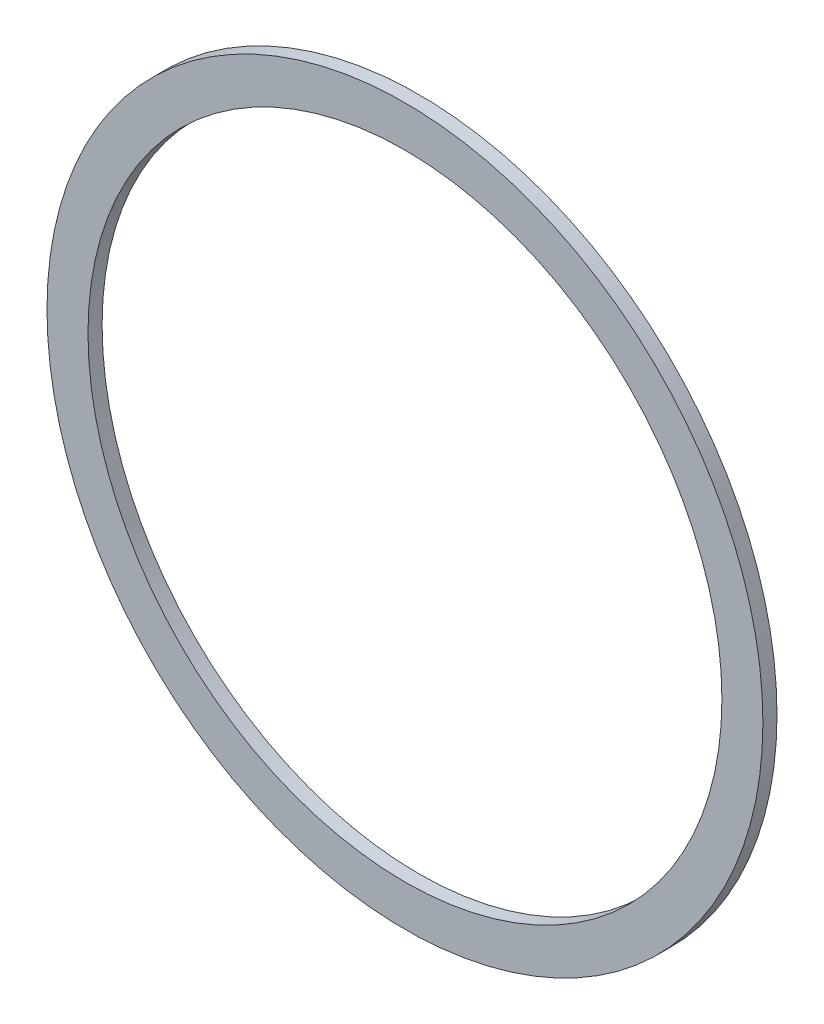
ISO-10303-21;
HEADER;
FILE_DESCRIPTION(('STEP AP214'),'2;1');
FILE_NAME('part.step','',(''),(''),'','','');
FILE_SCHEMA(('AUTOMOTIVE_DESIGN { 1 0 10303 214 1 1 1 1 }'));
ENDSEC;
DATA;
#1=APPLICATION_CONTEXT('core data for automotive mechanical design processes');
#2=APPLICATION_PROTOCOL_DEFINITION('international standard','automotive_design',2000,#1);
#3=PRODUCT_CONTEXT('',#1,'mechanical');
#4=PRODUCT('Part','Part','',(#3));
#5=PRODUCT_RELATED_PRODUCT_CATEGORY('part','',(#4));
#6=PRODUCT_DEFINITION_FORMATION('','',#4);
#7=PRODUCT_DEFINITION_CONTEXT('part definition',#1,'design');
#8=PRODUCT_DEFINITION('design','',#6,#7);
#9=PRODUCT_DEFINITION_SHAPE('','',#8);
#10=(LENGTH_UNIT() NAMED_UNIT(*) SI_UNIT(.MILLI.,.METRE.));
#11=(NAMED_UNIT(*) PLANE_ANGLE_UNIT() SI_UNIT($,.RADIAN.));
#12=(NAMED_UNIT(*) SI_UNIT($,.STERADIAN.) SOLID_ANGLE_UNIT());
#13=UNCERTAINTY_MEASURE_WITH_UNIT(LENGTH_MEASURE(1.E-05),#10,'distance_accuracy_value','');
#14=(GEOMETRIC_REPRESENTATION_CONTEXT(3) GLOBAL_UNCERTAINTY_ASSIGNED_CONTEXT((#13)) GLOBAL_UNIT_ASSIGNED_CONTEXT((#10,
#11,#12)) REPRESENTATION_CONTEXT('',''));
#15=CARTESIAN_POINT('',(0.,0.,0.));
#16=DIRECTION('',(0.,0.,1.));
#17=DIRECTION('',(1.,0.,0.));
#18=AXIS2_PLACEMENT_3D('',#15,#16,#17);
#19=CARTESIAN_POINT('',(0.,0.,2.));
#20=DIRECTION('',(0.,0.,1.));
#21=DIRECTION('',(1.,0.,0.));
#22=AXIS2_PLACEMENT_3D('',#19,#20,#21);
#23=PLANE('',#22);
#24=CARTESIAN_POINT('',(0.,0.,2.));
#25=DIRECTION('',(0.,0.,1.));
#26=DIRECTION('',(1.,0.,0.));
#27=AXIS2_PLACEMENT_3D('',#24,#25,#26);
#28=CIRCLE('',#27,101.5);
#29=CARTESIAN_POINT('',(101.5,0.,2.));
#30=VERTEX_POINT('',#29);
#31=EDGE_CURVE('E10',#30,#30,#28,.T.);
#32=ORIENTED_EDGE('',*,*,#31,.T.);
#33=EDGE_LOOP('',(#32));
#34=FACE_BOUND('',#33,.T.);
#35=CARTESIAN_POINT('',(0.,0.,2.));
#36=DIRECTION('',(0.,0.,1.));
#37=DIRECTION('',(1.,0.,0.));
#38=AXIS2_PLACEMENT_3D('',#35,#36,#37);
#39=CIRCLE('',#38,89.875);
#40=CARTESIAN_POINT('',(89.875,0.,2.));
#41=VERTEX_POINT('',#40);
#42=EDGE_CURVE('E54',#41,#41,#39,.T.);
#43=ORIENTED_EDGE('',*,*,#42,.F.);
#44=EDGE_LOOP('',(#43));
#45=FACE_BOUND('',#44,.T.);
#46=ADVANCED_FACE('F41',(#34,#45),#23,.T.);
#47=CARTESIAN_POINT('',(0.,0.,-2.));
#48=DIRECTION('',(0.,0.,1.));
#49=DIRECTION('',(1.,0.,0.));
#50=AXIS2_PLACEMENT_3D('',#47,#48,#49);
#51=PLANE('',#50);
#52=CARTESIAN_POINT('',(0.,0.,-2.));
#53=DIRECTION('',(0.,0.,1.));
#54=DIRECTION('',(1.,0.,0.));
#55=AXIS2_PLACEMENT_3D('',#52,#53,#54);
#56=CIRCLE('',#55,101.5);
#57=CARTESIAN_POINT('',(101.5,0.,-2.));
#58=VERTEX_POINT('',#57);
#59=EDGE_CURVE('E45',#58,#58,#56,.T.);
#60=ORIENTED_EDGE('',*,*,#59,.F.);
#61=EDGE_LOOP('',(#60));
#62=FACE_BOUND('',#61,.T.);
#63=CARTESIAN_POINT('',(0.,0.,-2.));
#64=DIRECTION('',(0.,0.,1.));
#65=DIRECTION('',(1.,0.,0.));
#66=AXIS2_PLACEMENT_3D('',#63,#64,#65);
#67=CIRCLE('',#66,89.875);
#68=CARTESIAN_POINT('',(89.875,0.,-2.));
#69=VERTEX_POINT('',#68);
#70=EDGE_CURVE('E56',#69,#69,#67,.T.);
#71=ORIENTED_EDGE('',*,*,#70,.T.);
#72=EDGE_LOOP('',(#71));
#73=FACE_BOUND('',#72,.T.);
#74=ADVANCED_FACE('F68',(#62,#73),#51,.F.);
#75=CARTESIAN_POINT('',(0.,0.,2.));
#76=DIRECTION('',(0.,0.,-1.));
#77=DIRECTION('',(-1.,0.,0.));
#78=AXIS2_PLACEMENT_3D('',#75,#76,#77);
#79=CYLINDRICAL_SURFACE('',#78,101.5);
#80=ORIENTED_EDGE('',*,*,#31,.F.);
#81=EDGE_LOOP('',(#80));
#82=FACE_BOUND('',#81,.T.);
#83=ORIENTED_EDGE('',*,*,#59,.T.);
#84=EDGE_LOOP('',(#83));
#85=FACE_BOUND('',#84,.T.);
#86=ADVANCED_FACE('F43',(#82,#85),#79,.T.);
#87=CARTESIAN_POINT('',(0.,0.,2.));
#88=DIRECTION('',(0.,0.,-1.));
#89=DIRECTION('',(-1.,0.,0.));
#90=AXIS2_PLACEMENT_3D('',#87,#88,#89);
#91=CYLINDRICAL_SURFACE('',#90,89.875);
#92=ORIENTED_EDGE('',*,*,#42,.T.);
#93=EDGE_LOOP('',(#92));
#94=FACE_BOUND('',#93,.T.);
#95=ORIENTED_EDGE('',*,*,#70,.F.);
#96=EDGE_LOOP('',(#95));
#97=FACE_BOUND('',#96,.T.);
#98=ADVANCED_FACE('F64',(#94,#97),#91,.F.);
#99=CLOSED_SHELL('',(#46,#74,#86,#98));
#100=MANIFOLD_SOLID_BREP('B2',#99);
#101=ADVANCED_BREP_SHAPE_REPRESENTATION('',(#18,#100),#14);
#102=SHAPE_DEFINITION_REPRESENTATION(#9,#101);
ENDSEC;
END-ISO-10303-21;
